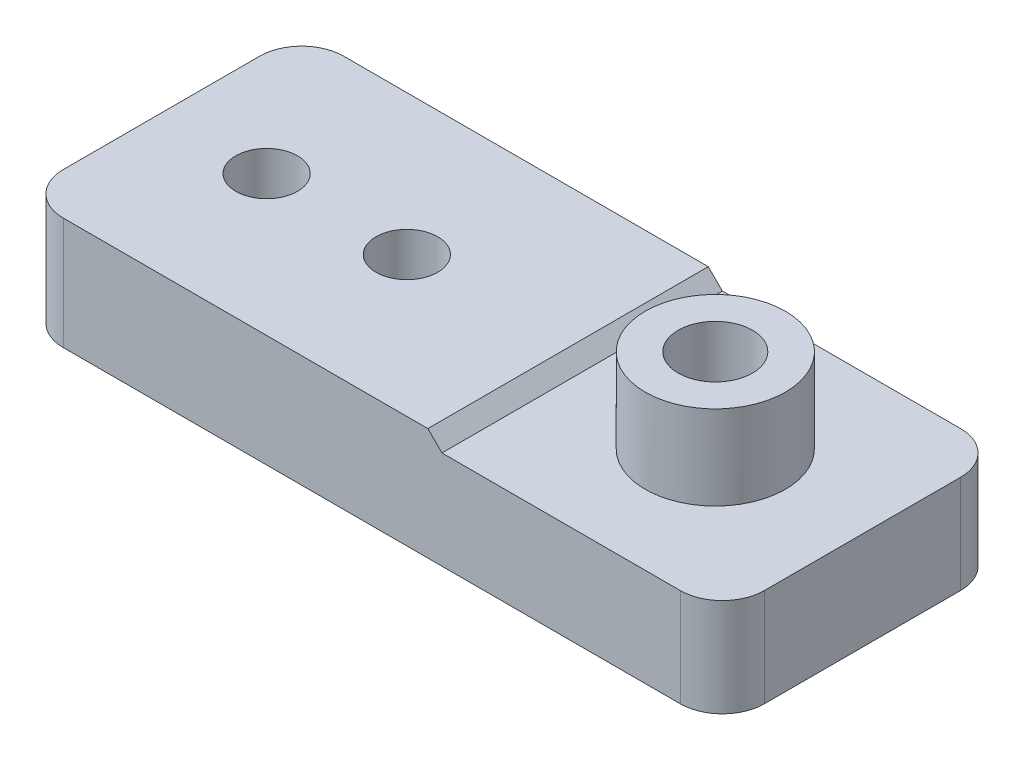
ISO-10303-21;
HEADER;
FILE_DESCRIPTION(('STEP AP214'),'2;1');
FILE_NAME('part.step','',(''),(''),'','','');
FILE_SCHEMA(('AUTOMOTIVE_DESIGN { 1 0 10303 214 1 1 1 1 }'));
ENDSEC;
DATA;
#1=APPLICATION_CONTEXT('core data for automotive mechanical design processes');
#2=APPLICATION_PROTOCOL_DEFINITION('international standard','automotive_design',2000,#1);
#3=PRODUCT_CONTEXT('',#1,'mechanical');
#4=PRODUCT('Part','Part','',(#3));
#5=PRODUCT_RELATED_PRODUCT_CATEGORY('part','',(#4));
#6=PRODUCT_DEFINITION_FORMATION('','',#4);
#7=PRODUCT_DEFINITION_CONTEXT('part definition',#1,'design');
#8=PRODUCT_DEFINITION('design','',#6,#7);
#9=PRODUCT_DEFINITION_SHAPE('','',#8);
#10=(LENGTH_UNIT() NAMED_UNIT(*) SI_UNIT(.MILLI.,.METRE.));
#11=(NAMED_UNIT(*) PLANE_ANGLE_UNIT() SI_UNIT($,.RADIAN.));
#12=(NAMED_UNIT(*) SI_UNIT($,.STERADIAN.) SOLID_ANGLE_UNIT());
#13=UNCERTAINTY_MEASURE_WITH_UNIT(LENGTH_MEASURE(1.E-05),#10,'distance_accuracy_value','');
#14=(GEOMETRIC_REPRESENTATION_CONTEXT(3) GLOBAL_UNCERTAINTY_ASSIGNED_CONTEXT((#13)) GLOBAL_UNIT_ASSIGNED_CONTEXT((#10,
#11,#12)) REPRESENTATION_CONTEXT('',''));
#15=CARTESIAN_POINT('',(0.,0.,0.));
#16=DIRECTION('',(0.,0.,1.));
#17=DIRECTION('',(1.,0.,0.));
#18=AXIS2_PLACEMENT_3D('',#15,#16,#17);
#19=CARTESIAN_POINT('',(-22.,8.,-6.99999999999999));
#20=DIRECTION('',(0.,-1.,0.));
#21=DIRECTION('',(0.,0.,-1.));
#22=AXIS2_PLACEMENT_3D('',#19,#20,#21);
#23=CYLINDRICAL_SURFACE('',#22,3.00000000000001);
#24=CARTESIAN_POINT('',(-22.,0.,-6.99999999999999));
#25=DIRECTION('',(0.,1.,0.));
#26=DIRECTION('',(0.,0.,1.));
#27=AXIS2_PLACEMENT_3D('',#24,#25,#26);
#28=CIRCLE('',#27,3.00000000000001);
#29=CARTESIAN_POINT('',(-25.,0.,-6.99999999999999));
#30=VERTEX_POINT('',#29);
#31=CARTESIAN_POINT('',(-22.,0.,-10.));
#32=VERTEX_POINT('',#31);
#33=EDGE_CURVE('E147',#30,#32,#28,.F.);
#34=ORIENTED_EDGE('',*,*,#33,.F.);
#35=DIRECTION('',(0.,-1.,0.));
#36=VECTOR('',#35,1.);
#37=CARTESIAN_POINT('',(-25.,8.,-6.99999999999999));
#38=LINE('',#37,#36);
#39=CARTESIAN_POINT('',(-25.,8.,-6.99999999999999));
#40=VERTEX_POINT('',#39);
#41=EDGE_CURVE('E92',#40,#30,#38,.T.);
#42=ORIENTED_EDGE('',*,*,#41,.F.);
#43=CARTESIAN_POINT('',(-22.,8.,-6.99999999999999));
#44=DIRECTION('',(0.,1.,0.));
#45=DIRECTION('',(0.,0.,1.));
#46=AXIS2_PLACEMENT_3D('',#43,#44,#45);
#47=CIRCLE('',#46,3.00000000000001);
#48=CARTESIAN_POINT('',(-22.,8.,-10.));
#49=VERTEX_POINT('',#48);
#50=EDGE_CURVE('E177',#40,#49,#47,.F.);
#51=ORIENTED_EDGE('',*,*,#50,.T.);
#52=DIRECTION('',(0.,-1.,0.));
#53=VECTOR('',#52,1.);
#54=CARTESIAN_POINT('',(-22.,8.,-10.));
#55=LINE('',#54,#53);
#56=EDGE_CURVE('E57',#49,#32,#55,.T.);
#57=ORIENTED_EDGE('',*,*,#56,.T.);
#58=EDGE_LOOP('',(#34,#42,#51,#57));
#59=FACE_BOUND('',#58,.T.);
#60=ADVANCED_FACE('F34',(#59),#23,.T.);
#61=CARTESIAN_POINT('',(-25.,8.,0.));
#62=DIRECTION('',(1.,0.,0.));
#63=DIRECTION('',(0.,0.,-1.));
#64=AXIS2_PLACEMENT_3D('',#61,#62,#63);
#65=PLANE('',#64);
#66=DIRECTION('',(0.,0.,1.));
#67=VECTOR('',#66,1.);
#68=CARTESIAN_POINT('',(-25.,0.,0.));
#69=LINE('',#68,#67);
#70=CARTESIAN_POINT('',(-25.,0.,6.99999999999999));
#71=VERTEX_POINT('',#70);
#72=EDGE_CURVE('E149',#30,#71,#69,.T.);
#73=ORIENTED_EDGE('',*,*,#72,.T.);
#74=DIRECTION('',(0.,-1.,0.));
#75=VECTOR('',#74,1.);
#76=CARTESIAN_POINT('',(-25.,8.,6.99999999999999));
#77=LINE('',#76,#75);
#78=CARTESIAN_POINT('',(-25.,8.,6.99999999999999));
#79=VERTEX_POINT('',#78);
#80=EDGE_CURVE('E189',#79,#71,#77,.T.);
#81=ORIENTED_EDGE('',*,*,#80,.F.);
#82=DIRECTION('',(0.,0.,1.));
#83=VECTOR('',#82,1.);
#84=CARTESIAN_POINT('',(-25.,8.,0.));
#85=LINE('',#84,#83);
#86=EDGE_CURVE('E138',#40,#79,#85,.T.);
#87=ORIENTED_EDGE('',*,*,#86,.F.);
#88=ORIENTED_EDGE('',*,*,#41,.T.);
#89=EDGE_LOOP('',(#73,#81,#87,#88));
#90=FACE_BOUND('',#89,.T.);
#91=ADVANCED_FACE('F193',(#90),#65,.F.);
#92=CARTESIAN_POINT('',(-22.,8.,7.));
#93=DIRECTION('',(0.,-1.,0.));
#94=DIRECTION('',(0.,0.,-1.));
#95=AXIS2_PLACEMENT_3D('',#92,#93,#94);
#96=CYLINDRICAL_SURFACE('',#95,3.);
#97=CARTESIAN_POINT('',(-22.,0.,7.));
#98=DIRECTION('',(0.,1.,0.));
#99=DIRECTION('',(0.,0.,1.));
#100=AXIS2_PLACEMENT_3D('',#97,#98,#99);
#101=CIRCLE('',#100,3.);
#102=CARTESIAN_POINT('',(-22.,0.,10.));
#103=VERTEX_POINT('',#102);
#104=EDGE_CURVE('E153',#103,#71,#101,.F.);
#105=ORIENTED_EDGE('',*,*,#104,.F.);
#106=DIRECTION('',(0.,-1.,0.));
#107=VECTOR('',#106,1.);
#108=CARTESIAN_POINT('',(-22.,8.,10.));
#109=LINE('',#108,#107);
#110=CARTESIAN_POINT('',(-22.,8.,10.));
#111=VERTEX_POINT('',#110);
#112=EDGE_CURVE('E187',#111,#103,#109,.T.);
#113=ORIENTED_EDGE('',*,*,#112,.F.);
#114=CARTESIAN_POINT('',(-22.,8.,7.));
#115=DIRECTION('',(0.,1.,0.));
#116=DIRECTION('',(0.,0.,1.));
#117=AXIS2_PLACEMENT_3D('',#114,#115,#116);
#118=CIRCLE('',#117,3.);
#119=EDGE_CURVE('E133',#111,#79,#118,.F.);
#120=ORIENTED_EDGE('',*,*,#119,.T.);
#121=ORIENTED_EDGE('',*,*,#80,.T.);
#122=EDGE_LOOP('',(#105,#113,#120,#121));
#123=FACE_BOUND('',#122,.T.);
#124=ADVANCED_FACE('F205',(#123),#96,.T.);
#125=CARTESIAN_POINT('',(0.,8.,10.));
#126=DIRECTION('',(0.,0.,-1.));
#127=DIRECTION('',(-1.,0.,0.));
#128=AXIS2_PLACEMENT_3D('',#125,#126,#127);
#129=PLANE('',#128);
#130=DIRECTION('',(0.,-1.,0.));
#131=VECTOR('',#130,1.);
#132=CARTESIAN_POINT('',(22.,8.,10.));
#133=LINE('',#132,#131);
#134=CARTESIAN_POINT('',(22.,6.9959083707151,10.));
#135=VERTEX_POINT('',#134);
#136=CARTESIAN_POINT('',(22.,0.,10.));
#137=VERTEX_POINT('',#136);
#138=EDGE_CURVE('E185',#135,#137,#133,.T.);
#139=ORIENTED_EDGE('',*,*,#138,.F.);
#140=DIRECTION('',(1.,0.,0.));
#141=VECTOR('',#140,1.);
#142=CARTESIAN_POINT('',(5.00409162928492,6.9959083707151,10.));
#143=LINE('',#142,#141);
#144=CARTESIAN_POINT('',(5.00409162928492,6.9959083707151,10.));
#145=VERTEX_POINT('',#144);
#146=EDGE_CURVE('E127',#145,#135,#143,.T.);
#147=ORIENTED_EDGE('',*,*,#146,.F.);
#148=DIRECTION('',(0.707106781186547,-0.707106781186548,0.));
#149=VECTOR('',#148,1.);
#150=CARTESIAN_POINT('',(4.00000000000002,8.,10.));
#151=LINE('',#150,#149);
#152=CARTESIAN_POINT('',(4.00000000000002,8.,10.));
#153=VERTEX_POINT('',#152);
#154=EDGE_CURVE('E116',#153,#145,#151,.T.);
#155=ORIENTED_EDGE('',*,*,#154,.F.);
#156=DIRECTION('',(1.,0.,0.));
#157=VECTOR('',#156,1.);
#158=CARTESIAN_POINT('',(0.,8.,10.));
#159=LINE('',#158,#157);
#160=EDGE_CURVE('E125',#111,#153,#159,.T.);
#161=ORIENTED_EDGE('',*,*,#160,.F.);
#162=ORIENTED_EDGE('',*,*,#112,.T.);
#163=DIRECTION('',(1.,0.,0.));
#164=VECTOR('',#163,1.);
#165=CARTESIAN_POINT('',(0.,0.,10.));
#166=LINE('',#165,#164);
#167=EDGE_CURVE('E156',#103,#137,#166,.T.);
#168=ORIENTED_EDGE('',*,*,#167,.T.);
#169=EDGE_LOOP('',(#139,#147,#155,#161,#162,#168));
#170=FACE_BOUND('',#169,.T.);
#171=ADVANCED_FACE('F124',(#170),#129,.F.);
#172=CARTESIAN_POINT('',(22.,8.,7.));
#173=DIRECTION('',(0.,-1.,0.));
#174=DIRECTION('',(0.,0.,-1.));
#175=AXIS2_PLACEMENT_3D('',#172,#173,#174);
#176=CYLINDRICAL_SURFACE('',#175,3.);
#177=DIRECTION('',(0.,-1.,0.));
#178=VECTOR('',#177,1.);
#179=CARTESIAN_POINT('',(25.,8.,6.99999999999998));
#180=LINE('',#179,#178);
#181=CARTESIAN_POINT('',(25.,6.9959083707151,6.99999999999998));
#182=VERTEX_POINT('',#181);
#183=CARTESIAN_POINT('',(25.,0.,6.99999999999998));
#184=VERTEX_POINT('',#183);
#185=EDGE_CURVE('E183',#182,#184,#180,.T.);
#186=ORIENTED_EDGE('',*,*,#185,.F.);
#187=CARTESIAN_POINT('',(22.,6.9959083707151,7.));
#188=DIRECTION('',(0.,-1.,0.));
#189=DIRECTION('',(0.,0.,-1.));
#190=AXIS2_PLACEMENT_3D('',#187,#188,#189);
#191=CIRCLE('',#190,3.);
#192=EDGE_CURVE('E150',#182,#135,#191,.T.);
#193=ORIENTED_EDGE('',*,*,#192,.T.);
#194=ORIENTED_EDGE('',*,*,#138,.T.);
#195=CARTESIAN_POINT('',(22.,0.,7.));
#196=DIRECTION('',(0.,1.,0.));
#197=DIRECTION('',(0.,0.,1.));
#198=AXIS2_PLACEMENT_3D('',#195,#196,#197);
#199=CIRCLE('',#198,3.);
#200=EDGE_CURVE('E159',#137,#184,#199,.T.);
#201=ORIENTED_EDGE('',*,*,#200,.T.);
#202=EDGE_LOOP('',(#186,#193,#194,#201));
#203=FACE_BOUND('',#202,.T.);
#204=ADVANCED_FACE('F214',(#203),#176,.T.);
#205=CARTESIAN_POINT('',(25.,8.,0.));
#206=DIRECTION('',(1.,0.,0.));
#207=DIRECTION('',(0.,0.,-1.));
#208=AXIS2_PLACEMENT_3D('',#205,#206,#207);
#209=PLANE('',#208);
#210=DIRECTION('',(0.,0.,-1.));
#211=VECTOR('',#210,1.);
#212=CARTESIAN_POINT('',(25.,6.9959083707151,0.));
#213=LINE('',#212,#211);
#214=CARTESIAN_POINT('',(25.,6.9959083707151,-6.99999999999999));
#215=VERTEX_POINT('',#214);
#216=EDGE_CURVE('E282',#182,#215,#213,.T.);
#217=ORIENTED_EDGE('',*,*,#216,.F.);
#218=ORIENTED_EDGE('',*,*,#185,.T.);
#219=DIRECTION('',(0.,0.,1.));
#220=VECTOR('',#219,1.);
#221=CARTESIAN_POINT('',(25.,0.,0.));
#222=LINE('',#221,#220);
#223=CARTESIAN_POINT('',(25.,0.,-6.99999999999999));
#224=VERTEX_POINT('',#223);
#225=EDGE_CURVE('E162',#224,#184,#222,.T.);
#226=ORIENTED_EDGE('',*,*,#225,.F.);
#227=DIRECTION('',(0.,-1.,0.));
#228=VECTOR('',#227,1.);
#229=CARTESIAN_POINT('',(25.,8.,-6.99999999999999));
#230=LINE('',#229,#228);
#231=EDGE_CURVE('E181',#215,#224,#230,.T.);
#232=ORIENTED_EDGE('',*,*,#231,.F.);
#233=EDGE_LOOP('',(#217,#218,#226,#232));
#234=FACE_BOUND('',#233,.T.);
#235=ADVANCED_FACE('F217',(#234),#209,.T.);
#236=CARTESIAN_POINT('',(22.,8.,-7.00000000000001));
#237=DIRECTION('',(0.,-1.,0.));
#238=DIRECTION('',(0.,0.,-1.));
#239=AXIS2_PLACEMENT_3D('',#236,#237,#238);
#240=CYLINDRICAL_SURFACE('',#239,3.);
#241=DIRECTION('',(0.,-1.,0.));
#242=VECTOR('',#241,1.);
#243=CARTESIAN_POINT('',(22.,8.,-10.));
#244=LINE('',#243,#242);
#245=CARTESIAN_POINT('',(22.,6.9959083707151,-10.));
#246=VERTEX_POINT('',#245);
#247=CARTESIAN_POINT('',(22.,0.,-10.));
#248=VERTEX_POINT('',#247);
#249=EDGE_CURVE('E179',#246,#248,#244,.T.);
#250=ORIENTED_EDGE('',*,*,#249,.F.);
#251=CARTESIAN_POINT('',(22.,6.9959083707151,-7.00000000000001));
#252=DIRECTION('',(0.,-1.,0.));
#253=DIRECTION('',(0.,0.,-1.));
#254=AXIS2_PLACEMENT_3D('',#251,#252,#253);
#255=CIRCLE('',#254,3.);
#256=EDGE_CURVE('E279',#246,#215,#255,.T.);
#257=ORIENTED_EDGE('',*,*,#256,.T.);
#258=ORIENTED_EDGE('',*,*,#231,.T.);
#259=CARTESIAN_POINT('',(22.,0.,-7.00000000000001));
#260=DIRECTION('',(0.,1.,0.));
#261=DIRECTION('',(0.,0.,1.));
#262=AXIS2_PLACEMENT_3D('',#259,#260,#261);
#263=CIRCLE('',#262,3.);
#264=EDGE_CURVE('E165',#224,#248,#263,.T.);
#265=ORIENTED_EDGE('',*,*,#264,.T.);
#266=EDGE_LOOP('',(#250,#257,#258,#265));
#267=FACE_BOUND('',#266,.T.);
#268=ADVANCED_FACE('F221',(#267),#240,.T.);
#269=CARTESIAN_POINT('',(-7.5,8.,0.));
#270=DIRECTION('',(0.,-1.,0.));
#271=DIRECTION('',(0.,0.,-1.));
#272=AXIS2_PLACEMENT_3D('',#269,#270,#271);
#273=CYLINDRICAL_SURFACE('',#272,2.2);
#274=CARTESIAN_POINT('',(-7.5,8.,0.));
#275=DIRECTION('',(0.,1.,0.));
#276=DIRECTION('',(0.,0.,1.));
#277=AXIS2_PLACEMENT_3D('',#274,#275,#276);
#278=CIRCLE('',#277,2.2);
#279=CARTESIAN_POINT('',(-7.5,8.,2.2));
#280=VERTEX_POINT('',#279);
#281=EDGE_CURVE('E136',#280,#280,#278,.T.);
#282=ORIENTED_EDGE('',*,*,#281,.T.);
#283=EDGE_LOOP('',(#282));
#284=FACE_BOUND('',#283,.T.);
#285=CARTESIAN_POINT('',(-7.5,0.,0.));
#286=DIRECTION('',(0.,1.,0.));
#287=DIRECTION('',(0.,0.,1.));
#288=AXIS2_PLACEMENT_3D('',#285,#286,#287);
#289=CIRCLE('',#288,2.2);
#290=CARTESIAN_POINT('',(-7.5,0.,2.2));
#291=VERTEX_POINT('',#290);
#292=EDGE_CURVE('E171',#291,#291,#289,.T.);
#293=ORIENTED_EDGE('',*,*,#292,.F.);
#294=EDGE_LOOP('',(#293));
#295=FACE_BOUND('',#294,.T.);
#296=ADVANCED_FACE('F225',(#284,#295),#273,.F.);
#297=CARTESIAN_POINT('',(0.,8.,-10.));
#298=DIRECTION('',(0.,0.,-1.));
#299=DIRECTION('',(-1.,0.,0.));
#300=AXIS2_PLACEMENT_3D('',#297,#298,#299);
#301=PLANE('',#300);
#302=DIRECTION('',(-1.,0.,0.));
#303=VECTOR('',#302,1.);
#304=CARTESIAN_POINT('',(0.,6.9959083707151,-10.));
#305=LINE('',#304,#303);
#306=CARTESIAN_POINT('',(5.00409162928492,6.9959083707151,-10.));
#307=VERTEX_POINT('',#306);
#308=EDGE_CURVE('E11',#246,#307,#305,.T.);
#309=ORIENTED_EDGE('',*,*,#308,.F.);
#310=ORIENTED_EDGE('',*,*,#249,.T.);
#311=DIRECTION('',(1.,0.,0.));
#312=VECTOR('',#311,1.);
#313=CARTESIAN_POINT('',(0.,0.,-10.));
#314=LINE('',#313,#312);
#315=EDGE_CURVE('E168',#32,#248,#314,.T.);
#316=ORIENTED_EDGE('',*,*,#315,.F.);
#317=ORIENTED_EDGE('',*,*,#56,.F.);
#318=DIRECTION('',(1.,0.,0.));
#319=VECTOR('',#318,1.);
#320=CARTESIAN_POINT('',(0.,8.,-10.));
#321=LINE('',#320,#319);
#322=CARTESIAN_POINT('',(4.00000000000002,8.,-10.));
#323=VERTEX_POINT('',#322);
#324=EDGE_CURVE('E134',#49,#323,#321,.T.);
#325=ORIENTED_EDGE('',*,*,#324,.T.);
#326=DIRECTION('',(-0.707106781186547,0.707106781186548,0.));
#327=VECTOR('',#326,1.);
#328=CARTESIAN_POINT('',(2.00000000000001,10.,-10.));
#329=LINE('',#328,#327);
#330=EDGE_CURVE('E48',#307,#323,#329,.T.);
#331=ORIENTED_EDGE('',*,*,#330,.F.);
#332=EDGE_LOOP('',(#309,#310,#316,#317,#325,#331));
#333=FACE_BOUND('',#332,.T.);
#334=ADVANCED_FACE('F227',(#333),#301,.T.);
#335=CARTESIAN_POINT('',(-17.5,8.,0.));
#336=DIRECTION('',(0.,-1.,0.));
#337=DIRECTION('',(0.,0.,-1.));
#338=AXIS2_PLACEMENT_3D('',#335,#336,#337);
#339=CYLINDRICAL_SURFACE('',#338,2.2);
#340=CARTESIAN_POINT('',(-17.5,8.,0.));
#341=DIRECTION('',(0.,1.,0.));
#342=DIRECTION('',(0.,0.,1.));
#343=AXIS2_PLACEMENT_3D('',#340,#341,#342);
#344=CIRCLE('',#343,2.2);
#345=CARTESIAN_POINT('',(-17.5,8.,2.2));
#346=VERTEX_POINT('',#345);
#347=EDGE_CURVE('E144',#346,#346,#344,.T.);
#348=ORIENTED_EDGE('',*,*,#347,.T.);
#349=EDGE_LOOP('',(#348));
#350=FACE_BOUND('',#349,.T.);
#351=CARTESIAN_POINT('',(-17.5,0.,0.));
#352=DIRECTION('',(0.,1.,0.));
#353=DIRECTION('',(0.,0.,1.));
#354=AXIS2_PLACEMENT_3D('',#351,#352,#353);
#355=CIRCLE('',#354,2.2);
#356=CARTESIAN_POINT('',(-17.5,0.,2.2));
#357=VERTEX_POINT('',#356);
#358=EDGE_CURVE('E174',#357,#357,#355,.T.);
#359=ORIENTED_EDGE('',*,*,#358,.F.);
#360=EDGE_LOOP('',(#359));
#361=FACE_BOUND('',#360,.T.);
#362=ADVANCED_FACE('F230',(#350,#361),#339,.F.);
#363=CARTESIAN_POINT('',(0.,8.,0.));
#364=DIRECTION('',(0.,1.,0.));
#365=DIRECTION('',(0.,0.,1.));
#366=AXIS2_PLACEMENT_3D('',#363,#364,#365);
#367=PLANE('',#366);
#368=DIRECTION('',(0.,0.,1.));
#369=VECTOR('',#368,1.);
#370=CARTESIAN_POINT('',(4.00000000000002,8.,0.));
#371=LINE('',#370,#369);
#372=EDGE_CURVE('E41',#323,#153,#371,.T.);
#373=ORIENTED_EDGE('',*,*,#372,.F.);
#374=ORIENTED_EDGE('',*,*,#324,.F.);
#375=ORIENTED_EDGE('',*,*,#50,.F.);
#376=ORIENTED_EDGE('',*,*,#86,.T.);
#377=ORIENTED_EDGE('',*,*,#119,.F.);
#378=ORIENTED_EDGE('',*,*,#160,.T.);
#379=EDGE_LOOP('',(#373,#374,#375,#376,#377,#378));
#380=FACE_BOUND('',#379,.T.);
#381=ORIENTED_EDGE('',*,*,#281,.F.);
#382=EDGE_LOOP('',(#381));
#383=FACE_BOUND('',#382,.T.);
#384=ORIENTED_EDGE('',*,*,#347,.F.);
#385=EDGE_LOOP('',(#384));
#386=FACE_BOUND('',#385,.T.);
#387=ADVANCED_FACE('F130',(#380,#383,#386),#367,.T.);
#388=CARTESIAN_POINT('',(0.,0.,0.));
#389=DIRECTION('',(0.,1.,0.));
#390=DIRECTION('',(0.,0.,1.));
#391=AXIS2_PLACEMENT_3D('',#388,#389,#390);
#392=PLANE('',#391);
#393=ORIENTED_EDGE('',*,*,#33,.T.);
#394=ORIENTED_EDGE('',*,*,#315,.T.);
#395=ORIENTED_EDGE('',*,*,#264,.F.);
#396=ORIENTED_EDGE('',*,*,#225,.T.);
#397=ORIENTED_EDGE('',*,*,#200,.F.);
#398=ORIENTED_EDGE('',*,*,#167,.F.);
#399=ORIENTED_EDGE('',*,*,#104,.T.);
#400=ORIENTED_EDGE('',*,*,#72,.F.);
#401=EDGE_LOOP('',(#393,#394,#395,#396,#397,#398,#399,#400));
#402=FACE_BOUND('',#401,.T.);
#403=ORIENTED_EDGE('',*,*,#292,.T.);
#404=EDGE_LOOP('',(#403));
#405=FACE_BOUND('',#404,.T.);
#406=ORIENTED_EDGE('',*,*,#358,.T.);
#407=EDGE_LOOP('',(#406));
#408=FACE_BOUND('',#407,.T.);
#409=CARTESIAN_POINT('',(14.5,0.,0.));
#410=DIRECTION('',(0.,1.,0.));
#411=DIRECTION('',(0.,0.,1.));
#412=AXIS2_PLACEMENT_3D('',#409,#410,#411);
#413=CIRCLE('',#412,2.65);
#414=CARTESIAN_POINT('',(14.5,0.,2.65));
#415=VERTEX_POINT('',#414);
#416=EDGE_CURVE('E270',#415,#415,#413,.T.);
#417=ORIENTED_EDGE('',*,*,#416,.T.);
#418=EDGE_LOOP('',(#417));
#419=FACE_BOUND('',#418,.T.);
#420=ADVANCED_FACE('F197',(#402,#405,#408,#419),#392,.F.);
#421=CARTESIAN_POINT('',(5.00409162928492,6.9959083707151,-16.));
#422=DIRECTION('',(0.,-1.,0.));
#423=DIRECTION('',(0.,0.,-1.));
#424=AXIS2_PLACEMENT_3D('',#421,#422,#423);
#425=PLANE('',#424);
#426=CARTESIAN_POINT('',(14.5,6.9959083707151,0.));
#427=DIRECTION('',(0.,-1.,0.));
#428=DIRECTION('',(0.,0.,-1.));
#429=AXIS2_PLACEMENT_3D('',#426,#427,#428);
#430=CIRCLE('',#429,5.);
#431=CARTESIAN_POINT('',(14.5,6.9959083707151,-5.));
#432=VERTEX_POINT('',#431);
#433=EDGE_CURVE('E128',#432,#432,#430,.F.);
#434=ORIENTED_EDGE('',*,*,#433,.F.);
#435=EDGE_LOOP('',(#434));
#436=FACE_BOUND('',#435,.T.);
#437=ORIENTED_EDGE('',*,*,#216,.T.);
#438=ORIENTED_EDGE('',*,*,#256,.F.);
#439=ORIENTED_EDGE('',*,*,#308,.T.);
#440=DIRECTION('',(0.,0.,1.));
#441=VECTOR('',#440,1.);
#442=CARTESIAN_POINT('',(5.00409162928492,6.9959083707151,-16.));
#443=LINE('',#442,#441);
#444=EDGE_CURVE('E276',#307,#145,#443,.T.);
#445=ORIENTED_EDGE('',*,*,#444,.T.);
#446=ORIENTED_EDGE('',*,*,#146,.T.);
#447=ORIENTED_EDGE('',*,*,#192,.F.);
#448=EDGE_LOOP('',(#437,#438,#439,#445,#446,#447));
#449=FACE_BOUND('',#448,.T.);
#450=ADVANCED_FACE('F239',(#436,#449),#425,.F.);
#451=CARTESIAN_POINT('',(4.00000000000002,8.,-16.));
#452=DIRECTION('',(-0.707106781186548,-0.707106781186547,0.));
#453=DIRECTION('',(0.707106781186547,-0.707106781186548,0.));
#454=AXIS2_PLACEMENT_3D('',#451,#452,#453);
#455=PLANE('',#454);
#456=ORIENTED_EDGE('',*,*,#330,.T.);
#457=ORIENTED_EDGE('',*,*,#372,.T.);
#458=ORIENTED_EDGE('',*,*,#154,.T.);
#459=ORIENTED_EDGE('',*,*,#444,.F.);
#460=EDGE_LOOP('',(#456,#457,#458,#459));
#461=FACE_BOUND('',#460,.T.);
#462=ADVANCED_FACE('F115',(#461),#455,.F.);
#463=CARTESIAN_POINT('',(14.5,13.,0.));
#464=DIRECTION('',(0.,-1.,0.));
#465=DIRECTION('',(0.,0.,-1.));
#466=AXIS2_PLACEMENT_3D('',#463,#464,#465);
#467=CYLINDRICAL_SURFACE('',#466,5.);
#468=CARTESIAN_POINT('',(14.5,13.,0.));
#469=DIRECTION('',(0.,1.,0.));
#470=DIRECTION('',(0.,0.,1.));
#471=AXIS2_PLACEMENT_3D('',#468,#469,#470);
#472=CIRCLE('',#471,5.);
#473=CARTESIAN_POINT('',(14.5,13.,5.));
#474=VERTEX_POINT('',#473);
#475=EDGE_CURVE('E266',#474,#474,#472,.T.);
#476=ORIENTED_EDGE('',*,*,#475,.F.);
#477=EDGE_LOOP('',(#476));
#478=FACE_BOUND('',#477,.T.);
#479=ORIENTED_EDGE('',*,*,#433,.T.);
#480=EDGE_LOOP('',(#479));
#481=FACE_BOUND('',#480,.T.);
#482=ADVANCED_FACE('F244',(#478,#481),#467,.T.);
#483=CARTESIAN_POINT('',(14.5,13.,0.));
#484=DIRECTION('',(0.,-1.,0.));
#485=DIRECTION('',(0.,0.,-1.));
#486=AXIS2_PLACEMENT_3D('',#483,#484,#485);
#487=CYLINDRICAL_SURFACE('',#486,2.65);
#488=CARTESIAN_POINT('',(14.5,13.,0.));
#489=DIRECTION('',(0.,1.,0.));
#490=DIRECTION('',(0.,0.,1.));
#491=AXIS2_PLACEMENT_3D('',#488,#489,#490);
#492=CIRCLE('',#491,2.65);
#493=CARTESIAN_POINT('',(14.5,13.,2.65));
#494=VERTEX_POINT('',#493);
#495=EDGE_CURVE('E263',#494,#494,#492,.T.);
#496=ORIENTED_EDGE('',*,*,#495,.T.);
#497=EDGE_LOOP('',(#496));
#498=FACE_BOUND('',#497,.T.);
#499=ORIENTED_EDGE('',*,*,#416,.F.);
#500=EDGE_LOOP('',(#499));
#501=FACE_BOUND('',#500,.T.);
#502=ADVANCED_FACE('F248',(#498,#501),#487,.F.);
#503=CARTESIAN_POINT('',(0.,13.,0.));
#504=DIRECTION('',(0.,1.,0.));
#505=DIRECTION('',(0.,0.,1.));
#506=AXIS2_PLACEMENT_3D('',#503,#504,#505);
#507=PLANE('',#506);
#508=ORIENTED_EDGE('',*,*,#495,.F.);
#509=EDGE_LOOP('',(#508));
#510=FACE_BOUND('',#509,.T.);
#511=ORIENTED_EDGE('',*,*,#475,.T.);
#512=EDGE_LOOP('',(#511));
#513=FACE_BOUND('',#512,.T.);
#514=ADVANCED_FACE('F251',(#510,#513),#507,.T.);
#515=CLOSED_SHELL('',(#60,#91,#124,#171,#204,#235,#268,#296,#334,#362,#387,#420,#450,#462,#482,
#502,#514));
#516=MANIFOLD_SOLID_BREP('B2',#515);
#517=ADVANCED_BREP_SHAPE_REPRESENTATION('',(#18,#516),#14);
#518=SHAPE_DEFINITION_REPRESENTATION(#9,#517);
ENDSEC;
END-ISO-10303-21;
